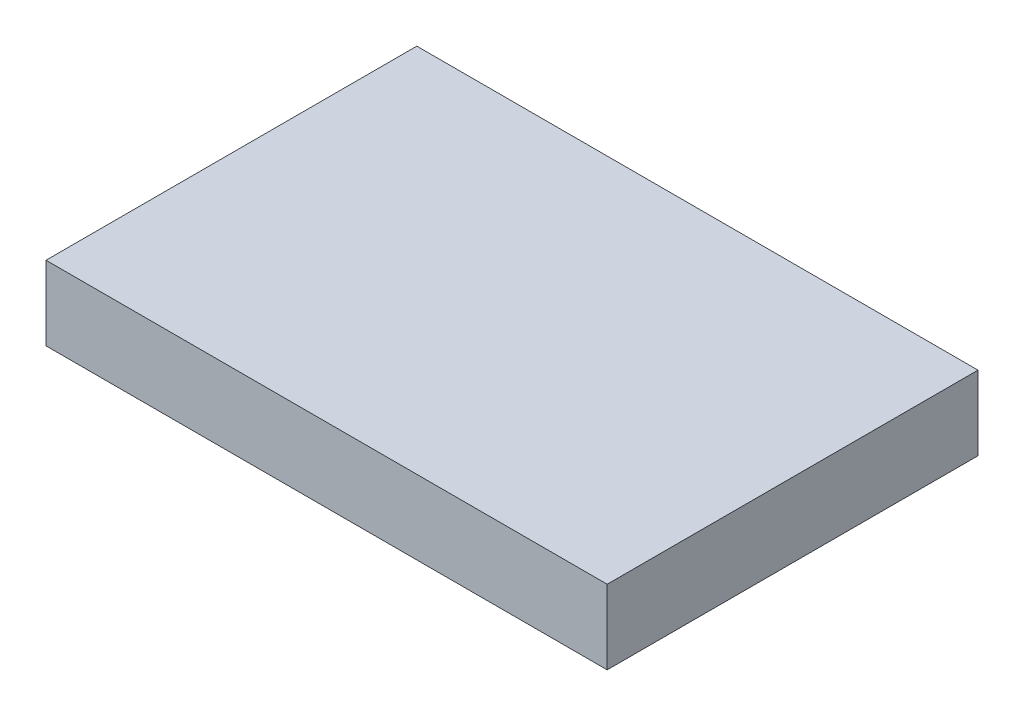
ISO-10303-21;
HEADER;
FILE_DESCRIPTION(('STEP AP214'),'2;1');
FILE_NAME('part.step','',(''),(''),'','','');
FILE_SCHEMA(('AUTOMOTIVE_DESIGN { 1 0 10303 214 1 1 1 1 }'));
ENDSEC;
DATA;
#1=APPLICATION_CONTEXT('core data for automotive mechanical design processes');
#2=APPLICATION_PROTOCOL_DEFINITION('international standard','automotive_design',2000,#1);
#3=PRODUCT_CONTEXT('',#1,'mechanical');
#4=PRODUCT('Part','Part','',(#3));
#5=PRODUCT_RELATED_PRODUCT_CATEGORY('part','',(#4));
#6=PRODUCT_DEFINITION_FORMATION('','',#4);
#7=PRODUCT_DEFINITION_CONTEXT('part definition',#1,'design');
#8=PRODUCT_DEFINITION('design','',#6,#7);
#9=PRODUCT_DEFINITION_SHAPE('','',#8);
#10=(LENGTH_UNIT() NAMED_UNIT(*) SI_UNIT(.MILLI.,.METRE.));
#11=(NAMED_UNIT(*) PLANE_ANGLE_UNIT() SI_UNIT($,.RADIAN.));
#12=(NAMED_UNIT(*) SI_UNIT($,.STERADIAN.) SOLID_ANGLE_UNIT());
#13=UNCERTAINTY_MEASURE_WITH_UNIT(LENGTH_MEASURE(1.E-05),#10,'distance_accuracy_value','');
#14=(GEOMETRIC_REPRESENTATION_CONTEXT(3) GLOBAL_UNCERTAINTY_ASSIGNED_CONTEXT((#13)) GLOBAL_UNIT_ASSIGNED_CONTEXT((#10,
#11,#12)) REPRESENTATION_CONTEXT('',''));
#15=CARTESIAN_POINT('',(0.,0.,0.));
#16=DIRECTION('',(0.,0.,1.));
#17=DIRECTION('',(1.,0.,0.));
#18=AXIS2_PLACEMENT_3D('',#15,#16,#17);
#19=CARTESIAN_POINT('',(0.,3.,0.));
#20=DIRECTION('',(1.,0.,0.));
#21=DIRECTION('',(0.,0.,-1.));
#22=AXIS2_PLACEMENT_3D('',#19,#20,#21);
#23=PLANE('',#22);
#24=DIRECTION('',(0.,0.,1.));
#25=VECTOR('',#24,1.);
#26=CARTESIAN_POINT('',(0.,0.,0.));
#27=LINE('',#26,#25);
#28=CARTESIAN_POINT('',(0.,0.,0.));
#29=VERTEX_POINT('',#28);
#30=CARTESIAN_POINT('',(0.,0.,15.));
#31=VERTEX_POINT('',#30);
#32=EDGE_CURVE('E96',#29,#31,#27,.T.);
#33=ORIENTED_EDGE('',*,*,#32,.T.);
#34=DIRECTION('',(0.,-1.,0.));
#35=VECTOR('',#34,1.);
#36=CARTESIAN_POINT('',(0.,3.,15.));
#37=LINE('',#36,#35);
#38=CARTESIAN_POINT('',(0.,3.,15.));
#39=VERTEX_POINT('',#38);
#40=EDGE_CURVE('E11',#39,#31,#37,.T.);
#41=ORIENTED_EDGE('',*,*,#40,.F.);
#42=DIRECTION('',(0.,0.,1.));
#43=VECTOR('',#42,1.);
#44=CARTESIAN_POINT('',(0.,3.,0.));
#45=LINE('',#44,#43);
#46=CARTESIAN_POINT('',(0.,3.,0.));
#47=VERTEX_POINT('',#46);
#48=EDGE_CURVE('E84',#47,#39,#45,.T.);
#49=ORIENTED_EDGE('',*,*,#48,.F.);
#50=DIRECTION('',(0.,-1.,0.));
#51=VECTOR('',#50,1.);
#52=CARTESIAN_POINT('',(0.,3.,0.));
#53=LINE('',#52,#51);
#54=EDGE_CURVE('E92',#47,#29,#53,.T.);
#55=ORIENTED_EDGE('',*,*,#54,.T.);
#56=EDGE_LOOP('',(#33,#41,#49,#55));
#57=FACE_BOUND('',#56,.T.);
#58=ADVANCED_FACE('F33',(#57),#23,.F.);
#59=CARTESIAN_POINT('',(0.,3.,15.));
#60=DIRECTION('',(0.,0.,-1.));
#61=DIRECTION('',(-1.,0.,0.));
#62=AXIS2_PLACEMENT_3D('',#59,#60,#61);
#63=PLANE('',#62);
#64=DIRECTION('',(1.,0.,0.));
#65=VECTOR('',#64,1.);
#66=CARTESIAN_POINT('',(0.,0.,15.));
#67=LINE('',#66,#65);
#68=CARTESIAN_POINT('',(22.7,0.,15.));
#69=VERTEX_POINT('',#68);
#70=EDGE_CURVE('E88',#31,#69,#67,.T.);
#71=ORIENTED_EDGE('',*,*,#70,.T.);
#72=DIRECTION('',(0.,-1.,0.));
#73=VECTOR('',#72,1.);
#74=CARTESIAN_POINT('',(22.7,3.,15.));
#75=LINE('',#74,#73);
#76=CARTESIAN_POINT('',(22.7,3.,15.));
#77=VERTEX_POINT('',#76);
#78=EDGE_CURVE('E41',#77,#69,#75,.T.);
#79=ORIENTED_EDGE('',*,*,#78,.F.);
#80=DIRECTION('',(1.,0.,0.));
#81=VECTOR('',#80,1.);
#82=CARTESIAN_POINT('',(0.,3.,15.));
#83=LINE('',#82,#81);
#84=EDGE_CURVE('E79',#39,#77,#83,.T.);
#85=ORIENTED_EDGE('',*,*,#84,.F.);
#86=ORIENTED_EDGE('',*,*,#40,.T.);
#87=EDGE_LOOP('',(#71,#79,#85,#86));
#88=FACE_BOUND('',#87,.T.);
#89=ADVANCED_FACE('F87',(#88),#63,.F.);
#90=CARTESIAN_POINT('',(22.7,3.,0.));
#91=DIRECTION('',(-1.,0.,0.));
#92=DIRECTION('',(0.,0.,1.));
#93=AXIS2_PLACEMENT_3D('',#90,#91,#92);
#94=PLANE('',#93);
#95=DIRECTION('',(0.,0.,-1.));
#96=VECTOR('',#95,1.);
#97=CARTESIAN_POINT('',(22.7,0.,0.));
#98=LINE('',#97,#96);
#99=CARTESIAN_POINT('',(22.7,0.,0.));
#100=VERTEX_POINT('',#99);
#101=EDGE_CURVE('E66',#69,#100,#98,.T.);
#102=ORIENTED_EDGE('',*,*,#101,.T.);
#103=DIRECTION('',(0.,-1.,0.));
#104=VECTOR('',#103,1.);
#105=CARTESIAN_POINT('',(22.7,3.,0.));
#106=LINE('',#105,#104);
#107=CARTESIAN_POINT('',(22.7,3.,0.));
#108=VERTEX_POINT('',#107);
#109=EDGE_CURVE('E89',#108,#100,#106,.T.);
#110=ORIENTED_EDGE('',*,*,#109,.F.);
#111=DIRECTION('',(0.,0.,-1.));
#112=VECTOR('',#111,1.);
#113=CARTESIAN_POINT('',(22.7,3.,0.));
#114=LINE('',#113,#112);
#115=EDGE_CURVE('E82',#77,#108,#114,.T.);
#116=ORIENTED_EDGE('',*,*,#115,.F.);
#117=ORIENTED_EDGE('',*,*,#78,.T.);
#118=EDGE_LOOP('',(#102,#110,#116,#117));
#119=FACE_BOUND('',#118,.T.);
#120=ADVANCED_FACE('F90',(#119),#94,.F.);
#121=CARTESIAN_POINT('',(0.,3.,0.));
#122=DIRECTION('',(0.,0.,1.));
#123=DIRECTION('',(1.,0.,0.));
#124=AXIS2_PLACEMENT_3D('',#121,#122,#123);
#125=PLANE('',#124);
#126=DIRECTION('',(-1.,0.,0.));
#127=VECTOR('',#126,1.);
#128=CARTESIAN_POINT('',(0.,0.,0.));
#129=LINE('',#128,#127);
#130=EDGE_CURVE('E72',#100,#29,#129,.T.);
#131=ORIENTED_EDGE('',*,*,#130,.T.);
#132=ORIENTED_EDGE('',*,*,#54,.F.);
#133=DIRECTION('',(-1.,0.,0.));
#134=VECTOR('',#133,1.);
#135=CARTESIAN_POINT('',(0.,3.,0.));
#136=LINE('',#135,#134);
#137=EDGE_CURVE('E49',#108,#47,#136,.T.);
#138=ORIENTED_EDGE('',*,*,#137,.F.);
#139=ORIENTED_EDGE('',*,*,#109,.T.);
#140=EDGE_LOOP('',(#131,#132,#138,#139));
#141=FACE_BOUND('',#140,.T.);
#142=ADVANCED_FACE('F103',(#141),#125,.F.);
#143=CARTESIAN_POINT('',(0.,3.,0.));
#144=DIRECTION('',(0.,1.,0.));
#145=DIRECTION('',(0.,0.,1.));
#146=AXIS2_PLACEMENT_3D('',#143,#144,#145);
#147=PLANE('',#146);
#148=ORIENTED_EDGE('',*,*,#48,.T.);
#149=ORIENTED_EDGE('',*,*,#84,.T.);
#150=ORIENTED_EDGE('',*,*,#115,.T.);
#151=ORIENTED_EDGE('',*,*,#137,.T.);
#152=EDGE_LOOP('',(#148,#149,#150,#151));
#153=FACE_BOUND('',#152,.T.);
#154=ADVANCED_FACE('F80',(#153),#147,.T.);
#155=CARTESIAN_POINT('',(0.,0.,0.));
#156=DIRECTION('',(0.,1.,0.));
#157=DIRECTION('',(0.,0.,1.));
#158=AXIS2_PLACEMENT_3D('',#155,#156,#157);
#159=PLANE('',#158);
#160=ORIENTED_EDGE('',*,*,#32,.F.);
#161=ORIENTED_EDGE('',*,*,#130,.F.);
#162=ORIENTED_EDGE('',*,*,#101,.F.);
#163=ORIENTED_EDGE('',*,*,#70,.F.);
#164=EDGE_LOOP('',(#160,#161,#162,#163));
#165=FACE_BOUND('',#164,.T.);
#166=ADVANCED_FACE('F106',(#165),#159,.F.);
#167=CLOSED_SHELL('',(#58,#89,#120,#142,#154,#166));
#168=MANIFOLD_SOLID_BREP('B2',#167);
#169=ADVANCED_BREP_SHAPE_REPRESENTATION('',(#18,#168),#14);
#170=SHAPE_DEFINITION_REPRESENTATION(#9,#169);
ENDSEC;
END-ISO-10303-21;
